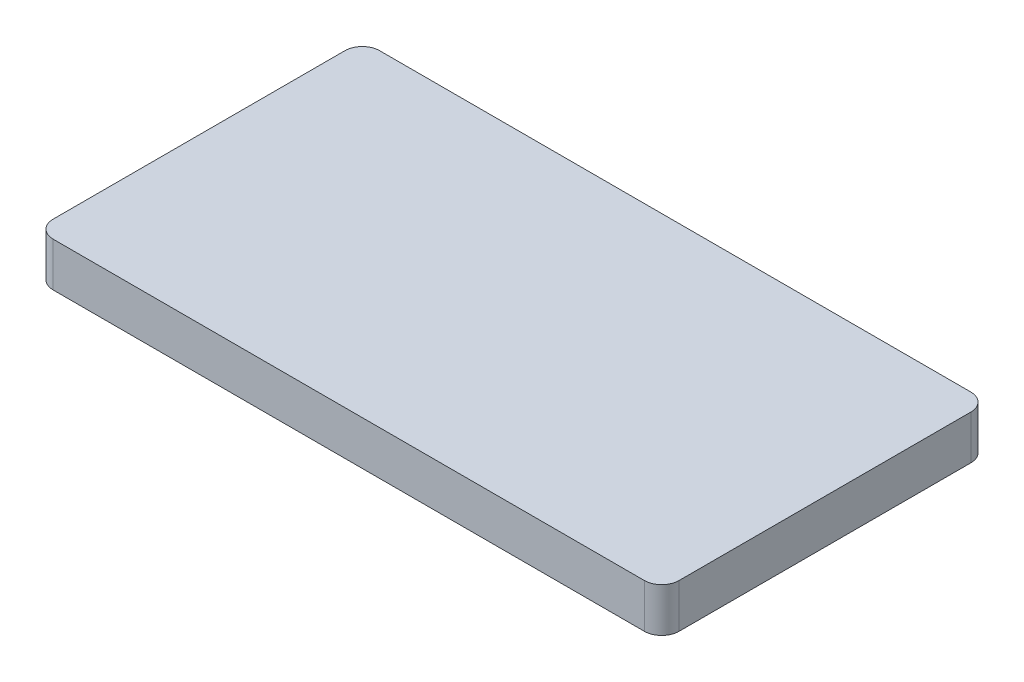
ISO-10303-21;
HEADER;
FILE_DESCRIPTION(('STEP AP214'),'2;1');
FILE_NAME('part.step','',(''),(''),'','','');
FILE_SCHEMA(('AUTOMOTIVE_DESIGN { 1 0 10303 214 1 1 1 1 }'));
ENDSEC;
DATA;
#1=APPLICATION_CONTEXT('core data for automotive mechanical design processes');
#2=APPLICATION_PROTOCOL_DEFINITION('international standard','automotive_design',2000,#1);
#3=PRODUCT_CONTEXT('',#1,'mechanical');
#4=PRODUCT('Part','Part','',(#3));
#5=PRODUCT_RELATED_PRODUCT_CATEGORY('part','',(#4));
#6=PRODUCT_DEFINITION_FORMATION('','',#4);
#7=PRODUCT_DEFINITION_CONTEXT('part definition',#1,'design');
#8=PRODUCT_DEFINITION('design','',#6,#7);
#9=PRODUCT_DEFINITION_SHAPE('','',#8);
#10=(LENGTH_UNIT() NAMED_UNIT(*) SI_UNIT(.MILLI.,.METRE.));
#11=(NAMED_UNIT(*) PLANE_ANGLE_UNIT() SI_UNIT($,.RADIAN.));
#12=(NAMED_UNIT(*) SI_UNIT($,.STERADIAN.) SOLID_ANGLE_UNIT());
#13=UNCERTAINTY_MEASURE_WITH_UNIT(LENGTH_MEASURE(1.E-05),#10,'distance_accuracy_value','');
#14=(GEOMETRIC_REPRESENTATION_CONTEXT(3) GLOBAL_UNCERTAINTY_ASSIGNED_CONTEXT((#13)) GLOBAL_UNIT_ASSIGNED_CONTEXT((#10,
#11,#12)) REPRESENTATION_CONTEXT('',''));
#15=CARTESIAN_POINT('',(0.,0.,0.));
#16=DIRECTION('',(0.,0.,1.));
#17=DIRECTION('',(1.,0.,0.));
#18=AXIS2_PLACEMENT_3D('',#15,#16,#17);
#19=CARTESIAN_POINT('',(-45.15,6.35,-23.55));
#20=DIRECTION('',(1.,0.,0.));
#21=DIRECTION('',(0.,0.,-1.));
#22=AXIS2_PLACEMENT_3D('',#19,#20,#21);
#23=PLANE('',#22);
#24=DIRECTION('',(0.,0.,1.));
#25=VECTOR('',#24,1.);
#26=CARTESIAN_POINT('',(-45.15,6.35,-23.55));
#27=LINE('',#26,#25);
#28=CARTESIAN_POINT('',(-45.15,6.35,-21.05));
#29=VERTEX_POINT('',#28);
#30=CARTESIAN_POINT('',(-45.15,6.35,21.05));
#31=VERTEX_POINT('',#30);
#32=EDGE_CURVE('E129',#29,#31,#27,.T.);
#33=ORIENTED_EDGE('',*,*,#32,.F.);
#34=DIRECTION('',(0.,-1.,0.));
#35=VECTOR('',#34,1.);
#36=CARTESIAN_POINT('',(-45.15,6.35,-21.05));
#37=LINE('',#36,#35);
#38=CARTESIAN_POINT('',(-45.15,0.,-21.05));
#39=VERTEX_POINT('',#38);
#40=EDGE_CURVE('E113',#29,#39,#37,.T.);
#41=ORIENTED_EDGE('',*,*,#40,.T.);
#42=DIRECTION('',(0.,0.,1.));
#43=VECTOR('',#42,1.);
#44=CARTESIAN_POINT('',(-45.15,0.,-23.55));
#45=LINE('',#44,#43);
#46=CARTESIAN_POINT('',(-45.15,0.,21.05));
#47=VERTEX_POINT('',#46);
#48=EDGE_CURVE('E126',#39,#47,#45,.T.);
#49=ORIENTED_EDGE('',*,*,#48,.T.);
#50=DIRECTION('',(0.,-1.,0.));
#51=VECTOR('',#50,1.);
#52=CARTESIAN_POINT('',(-45.15,6.35,21.05));
#53=LINE('',#52,#51);
#54=EDGE_CURVE('E132',#47,#31,#53,.F.);
#55=ORIENTED_EDGE('',*,*,#54,.T.);
#56=EDGE_LOOP('',(#33,#41,#49,#55));
#57=FACE_BOUND('',#56,.T.);
#58=ADVANCED_FACE('F43',(#57),#23,.F.);
#59=CARTESIAN_POINT('',(-45.15,6.35,23.55));
#60=DIRECTION('',(0.,0.,-1.));
#61=DIRECTION('',(-1.,0.,0.));
#62=AXIS2_PLACEMENT_3D('',#59,#60,#61);
#63=PLANE('',#62);
#64=DIRECTION('',(1.,0.,0.));
#65=VECTOR('',#64,1.);
#66=CARTESIAN_POINT('',(-45.15,6.35,23.55));
#67=LINE('',#66,#65);
#68=CARTESIAN_POINT('',(-42.65,6.35,23.55));
#69=VERTEX_POINT('',#68);
#70=CARTESIAN_POINT('',(42.65,6.35,23.55));
#71=VERTEX_POINT('',#70);
#72=EDGE_CURVE('E200',#69,#71,#67,.T.);
#73=ORIENTED_EDGE('',*,*,#72,.F.);
#74=DIRECTION('',(0.,-1.,0.));
#75=VECTOR('',#74,1.);
#76=CARTESIAN_POINT('',(-42.65,6.35,23.55));
#77=LINE('',#76,#75);
#78=CARTESIAN_POINT('',(-42.65,0.,23.55));
#79=VERTEX_POINT('',#78);
#80=EDGE_CURVE('E180',#69,#79,#77,.T.);
#81=ORIENTED_EDGE('',*,*,#80,.T.);
#82=DIRECTION('',(1.,0.,0.));
#83=VECTOR('',#82,1.);
#84=CARTESIAN_POINT('',(-45.15,0.,23.55));
#85=LINE('',#84,#83);
#86=CARTESIAN_POINT('',(42.65,0.,23.55));
#87=VERTEX_POINT('',#86);
#88=EDGE_CURVE('E137',#79,#87,#85,.T.);
#89=ORIENTED_EDGE('',*,*,#88,.T.);
#90=DIRECTION('',(0.,-1.,0.));
#91=VECTOR('',#90,1.);
#92=CARTESIAN_POINT('',(42.65,6.35,23.55));
#93=LINE('',#92,#91);
#94=EDGE_CURVE('E177',#87,#71,#93,.F.);
#95=ORIENTED_EDGE('',*,*,#94,.T.);
#96=EDGE_LOOP('',(#73,#81,#89,#95));
#97=FACE_BOUND('',#96,.T.);
#98=ADVANCED_FACE('F212',(#97),#63,.F.);
#99=CARTESIAN_POINT('',(45.15,6.35,-23.55));
#100=DIRECTION('',(-1.,0.,0.));
#101=DIRECTION('',(0.,0.,1.));
#102=AXIS2_PLACEMENT_3D('',#99,#100,#101);
#103=PLANE('',#102);
#104=DIRECTION('',(0.,0.,-1.));
#105=VECTOR('',#104,1.);
#106=CARTESIAN_POINT('',(45.15,0.,-23.55));
#107=LINE('',#106,#105);
#108=CARTESIAN_POINT('',(45.15,0.,21.05));
#109=VERTEX_POINT('',#108);
#110=CARTESIAN_POINT('',(45.15,0.,-21.05));
#111=VERTEX_POINT('',#110);
#112=EDGE_CURVE('E141',#109,#111,#107,.T.);
#113=ORIENTED_EDGE('',*,*,#112,.T.);
#114=DIRECTION('',(0.,-1.,0.));
#115=VECTOR('',#114,1.);
#116=CARTESIAN_POINT('',(45.15,6.35,-21.05));
#117=LINE('',#116,#115);
#118=CARTESIAN_POINT('',(45.15,6.35,-21.05));
#119=VERTEX_POINT('',#118);
#120=EDGE_CURVE('E11',#111,#119,#117,.F.);
#121=ORIENTED_EDGE('',*,*,#120,.T.);
#122=DIRECTION('',(0.,0.,-1.));
#123=VECTOR('',#122,1.);
#124=CARTESIAN_POINT('',(45.15,6.35,-23.55));
#125=LINE('',#124,#123);
#126=CARTESIAN_POINT('',(45.15,6.35,21.05));
#127=VERTEX_POINT('',#126);
#128=EDGE_CURVE('E188',#127,#119,#125,.T.);
#129=ORIENTED_EDGE('',*,*,#128,.F.);
#130=DIRECTION('',(0.,-1.,0.));
#131=VECTOR('',#130,1.);
#132=CARTESIAN_POINT('',(45.15,6.35,21.05));
#133=LINE('',#132,#131);
#134=EDGE_CURVE('E52',#127,#109,#133,.T.);
#135=ORIENTED_EDGE('',*,*,#134,.T.);
#136=EDGE_LOOP('',(#113,#121,#129,#135));
#137=FACE_BOUND('',#136,.T.);
#138=ADVANCED_FACE('F187',(#137),#103,.F.);
#139=CARTESIAN_POINT('',(-45.15,6.35,-23.55));
#140=DIRECTION('',(0.,0.,1.));
#141=DIRECTION('',(1.,0.,0.));
#142=AXIS2_PLACEMENT_3D('',#139,#140,#141);
#143=PLANE('',#142);
#144=DIRECTION('',(-1.,0.,0.));
#145=VECTOR('',#144,1.);
#146=CARTESIAN_POINT('',(-45.15,0.,-23.55));
#147=LINE('',#146,#145);
#148=CARTESIAN_POINT('',(42.65,0.,-23.55));
#149=VERTEX_POINT('',#148);
#150=CARTESIAN_POINT('',(-42.65,0.,-23.55));
#151=VERTEX_POINT('',#150);
#152=EDGE_CURVE('E149',#149,#151,#147,.T.);
#153=ORIENTED_EDGE('',*,*,#152,.T.);
#154=DIRECTION('',(0.,-1.,0.));
#155=VECTOR('',#154,1.);
#156=CARTESIAN_POINT('',(-42.65,6.35,-23.55));
#157=LINE('',#156,#155);
#158=CARTESIAN_POINT('',(-42.65,6.35,-23.55));
#159=VERTEX_POINT('',#158);
#160=EDGE_CURVE('E114',#151,#159,#157,.F.);
#161=ORIENTED_EDGE('',*,*,#160,.T.);
#162=DIRECTION('',(-1.,0.,0.));
#163=VECTOR('',#162,1.);
#164=CARTESIAN_POINT('',(-45.15,6.35,-23.55));
#165=LINE('',#164,#163);
#166=CARTESIAN_POINT('',(42.65,6.35,-23.55));
#167=VERTEX_POINT('',#166);
#168=EDGE_CURVE('E144',#167,#159,#165,.T.);
#169=ORIENTED_EDGE('',*,*,#168,.F.);
#170=DIRECTION('',(0.,-1.,0.));
#171=VECTOR('',#170,1.);
#172=CARTESIAN_POINT('',(42.65,6.35,-23.55));
#173=LINE('',#172,#171);
#174=EDGE_CURVE('E120',#167,#149,#173,.T.);
#175=ORIENTED_EDGE('',*,*,#174,.T.);
#176=EDGE_LOOP('',(#153,#161,#169,#175));
#177=FACE_BOUND('',#176,.T.);
#178=ADVANCED_FACE('F196',(#177),#143,.F.);
#179=CARTESIAN_POINT('',(0.,6.35,0.));
#180=DIRECTION('',(0.,1.,0.));
#181=DIRECTION('',(0.,0.,1.));
#182=AXIS2_PLACEMENT_3D('',#179,#180,#181);
#183=PLANE('',#182);
#184=ORIENTED_EDGE('',*,*,#168,.T.);
#185=CARTESIAN_POINT('',(-42.65,6.35,-21.05));
#186=DIRECTION('',(0.,1.,0.));
#187=DIRECTION('',(0.,0.,1.));
#188=AXIS2_PLACEMENT_3D('',#185,#186,#187);
#189=CIRCLE('',#188,2.5);
#190=EDGE_CURVE('E174',#159,#29,#189,.T.);
#191=ORIENTED_EDGE('',*,*,#190,.T.);
#192=ORIENTED_EDGE('',*,*,#32,.T.);
#193=CARTESIAN_POINT('',(-42.65,6.35,21.05));
#194=DIRECTION('',(0.,1.,0.));
#195=DIRECTION('',(0.,0.,1.));
#196=AXIS2_PLACEMENT_3D('',#193,#194,#195);
#197=CIRCLE('',#196,2.5);
#198=EDGE_CURVE('E171',#31,#69,#197,.T.);
#199=ORIENTED_EDGE('',*,*,#198,.T.);
#200=ORIENTED_EDGE('',*,*,#72,.T.);
#201=CARTESIAN_POINT('',(42.65,6.35,21.05));
#202=DIRECTION('',(0.,1.,0.));
#203=DIRECTION('',(0.,0.,1.));
#204=AXIS2_PLACEMENT_3D('',#201,#202,#203);
#205=CIRCLE('',#204,2.5);
#206=EDGE_CURVE('E64',#71,#127,#205,.T.);
#207=ORIENTED_EDGE('',*,*,#206,.T.);
#208=ORIENTED_EDGE('',*,*,#128,.T.);
#209=CARTESIAN_POINT('',(42.65,6.35,-21.05));
#210=DIRECTION('',(0.,1.,0.));
#211=DIRECTION('',(0.,0.,1.));
#212=AXIS2_PLACEMENT_3D('',#209,#210,#211);
#213=CIRCLE('',#212,2.5);
#214=EDGE_CURVE('E168',#119,#167,#213,.T.);
#215=ORIENTED_EDGE('',*,*,#214,.T.);
#216=EDGE_LOOP('',(#184,#191,#192,#199,#200,#207,#208,#215));
#217=FACE_BOUND('',#216,.T.);
#218=ADVANCED_FACE('F206',(#217),#183,.T.);
#219=CARTESIAN_POINT('',(0.,0.,0.));
#220=DIRECTION('',(0.,1.,0.));
#221=DIRECTION('',(0.,0.,1.));
#222=AXIS2_PLACEMENT_3D('',#219,#220,#221);
#223=PLANE('',#222);
#224=ORIENTED_EDGE('',*,*,#48,.F.);
#225=CARTESIAN_POINT('',(-42.65,0.,-21.05));
#226=DIRECTION('',(0.,1.,0.));
#227=DIRECTION('',(0.,0.,1.));
#228=AXIS2_PLACEMENT_3D('',#225,#226,#227);
#229=CIRCLE('',#228,2.5);
#230=EDGE_CURVE('E109',#39,#151,#229,.F.);
#231=ORIENTED_EDGE('',*,*,#230,.T.);
#232=ORIENTED_EDGE('',*,*,#152,.F.);
#233=CARTESIAN_POINT('',(42.65,0.,-21.05));
#234=DIRECTION('',(0.,1.,0.));
#235=DIRECTION('',(0.,0.,1.));
#236=AXIS2_PLACEMENT_3D('',#233,#234,#235);
#237=CIRCLE('',#236,2.5);
#238=EDGE_CURVE('E156',#149,#111,#237,.F.);
#239=ORIENTED_EDGE('',*,*,#238,.T.);
#240=ORIENTED_EDGE('',*,*,#112,.F.);
#241=CARTESIAN_POINT('',(42.65,0.,21.05));
#242=DIRECTION('',(0.,1.,0.));
#243=DIRECTION('',(0.,0.,1.));
#244=AXIS2_PLACEMENT_3D('',#241,#242,#243);
#245=CIRCLE('',#244,2.5);
#246=EDGE_CURVE('E131',#109,#87,#245,.F.);
#247=ORIENTED_EDGE('',*,*,#246,.T.);
#248=ORIENTED_EDGE('',*,*,#88,.F.);
#249=CARTESIAN_POINT('',(-42.65,0.,21.05));
#250=DIRECTION('',(0.,1.,0.));
#251=DIRECTION('',(0.,0.,1.));
#252=AXIS2_PLACEMENT_3D('',#249,#250,#251);
#253=CIRCLE('',#252,2.5);
#254=EDGE_CURVE('E121',#79,#47,#253,.F.);
#255=ORIENTED_EDGE('',*,*,#254,.T.);
#256=EDGE_LOOP('',(#224,#231,#232,#239,#240,#247,#248,#255));
#257=FACE_BOUND('',#256,.T.);
#258=ADVANCED_FACE('F134',(#257),#223,.F.);
#259=CARTESIAN_POINT('',(-42.65,6.35,-21.05));
#260=DIRECTION('',(0.,-1.,0.));
#261=DIRECTION('',(0.,0.,-1.));
#262=AXIS2_PLACEMENT_3D('',#259,#260,#261);
#263=CYLINDRICAL_SURFACE('',#262,2.5);
#264=ORIENTED_EDGE('',*,*,#190,.F.);
#265=ORIENTED_EDGE('',*,*,#160,.F.);
#266=ORIENTED_EDGE('',*,*,#230,.F.);
#267=ORIENTED_EDGE('',*,*,#40,.F.);
#268=EDGE_LOOP('',(#264,#265,#266,#267));
#269=FACE_BOUND('',#268,.T.);
#270=ADVANCED_FACE('F112',(#269),#263,.T.);
#271=CARTESIAN_POINT('',(-42.65,6.35,21.05));
#272=DIRECTION('',(0.,-1.,0.));
#273=DIRECTION('',(0.,0.,-1.));
#274=AXIS2_PLACEMENT_3D('',#271,#272,#273);
#275=CYLINDRICAL_SURFACE('',#274,2.5);
#276=ORIENTED_EDGE('',*,*,#198,.F.);
#277=ORIENTED_EDGE('',*,*,#54,.F.);
#278=ORIENTED_EDGE('',*,*,#254,.F.);
#279=ORIENTED_EDGE('',*,*,#80,.F.);
#280=EDGE_LOOP('',(#276,#277,#278,#279));
#281=FACE_BOUND('',#280,.T.);
#282=ADVANCED_FACE('F210',(#281),#275,.T.);
#283=CARTESIAN_POINT('',(42.65,6.35,-21.05));
#284=DIRECTION('',(0.,-1.,0.));
#285=DIRECTION('',(0.,0.,-1.));
#286=AXIS2_PLACEMENT_3D('',#283,#284,#285);
#287=CYLINDRICAL_SURFACE('',#286,2.5);
#288=ORIENTED_EDGE('',*,*,#214,.F.);
#289=ORIENTED_EDGE('',*,*,#120,.F.);
#290=ORIENTED_EDGE('',*,*,#238,.F.);
#291=ORIENTED_EDGE('',*,*,#174,.F.);
#292=EDGE_LOOP('',(#288,#289,#290,#291));
#293=FACE_BOUND('',#292,.T.);
#294=ADVANCED_FACE('F193',(#293),#287,.T.);
#295=CARTESIAN_POINT('',(42.65,6.35,21.05));
#296=DIRECTION('',(0.,-1.,0.));
#297=DIRECTION('',(0.,0.,-1.));
#298=AXIS2_PLACEMENT_3D('',#295,#296,#297);
#299=CYLINDRICAL_SURFACE('',#298,2.5);
#300=ORIENTED_EDGE('',*,*,#206,.F.);
#301=ORIENTED_EDGE('',*,*,#94,.F.);
#302=ORIENTED_EDGE('',*,*,#246,.F.);
#303=ORIENTED_EDGE('',*,*,#134,.F.);
#304=EDGE_LOOP('',(#300,#301,#302,#303));
#305=FACE_BOUND('',#304,.T.);
#306=ADVANCED_FACE('F45',(#305),#299,.T.);
#307=CLOSED_SHELL('',(#58,#98,#138,#178,#218,#258,#270,#282,#294,#306));
#308=MANIFOLD_SOLID_BREP('B2',#307);
#309=ADVANCED_BREP_SHAPE_REPRESENTATION('',(#18,#308),#14);
#310=SHAPE_DEFINITION_REPRESENTATION(#9,#309);
ENDSEC;
END-ISO-10303-21;
